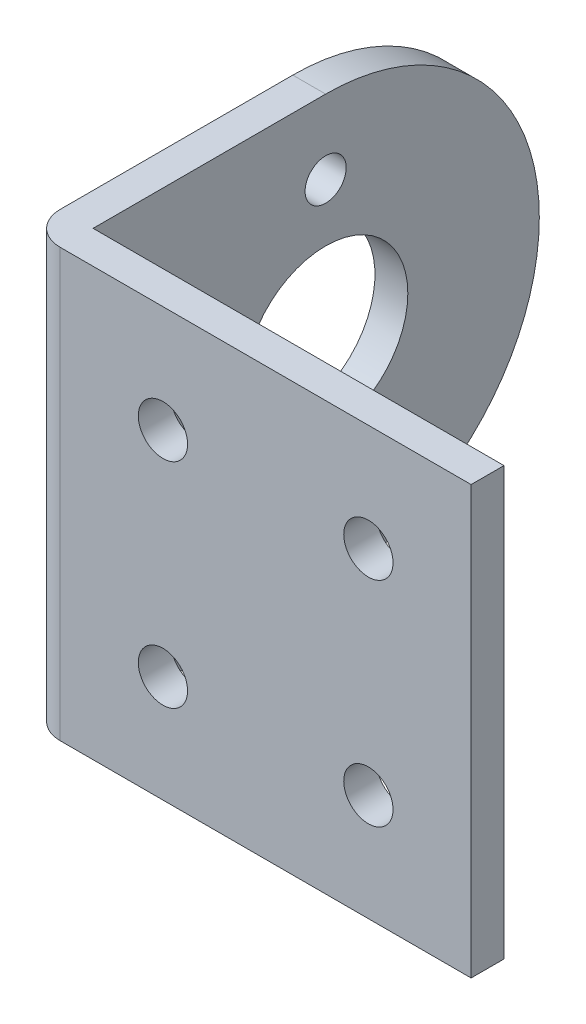
ISO-10303-21;
HEADER;
FILE_DESCRIPTION(('STEP AP214'),'2;1');
FILE_NAME('part.step','',(''),(''),'','','');
FILE_SCHEMA(('AUTOMOTIVE_DESIGN { 1 0 10303 214 1 1 1 1 }'));
ENDSEC;
DATA;
#1=APPLICATION_CONTEXT('core data for automotive mechanical design processes');
#2=APPLICATION_PROTOCOL_DEFINITION('international standard','automotive_design',2000,#1);
#3=PRODUCT_CONTEXT('',#1,'mechanical');
#4=PRODUCT('Part','Part','',(#3));
#5=PRODUCT_RELATED_PRODUCT_CATEGORY('part','',(#4));
#6=PRODUCT_DEFINITION_FORMATION('','',#4);
#7=PRODUCT_DEFINITION_CONTEXT('part definition',#1,'design');
#8=PRODUCT_DEFINITION('design','',#6,#7);
#9=PRODUCT_DEFINITION_SHAPE('','',#8);
#10=(LENGTH_UNIT() NAMED_UNIT(*) SI_UNIT(.MILLI.,.METRE.));
#11=(NAMED_UNIT(*) PLANE_ANGLE_UNIT() SI_UNIT($,.RADIAN.));
#12=(NAMED_UNIT(*) SI_UNIT($,.STERADIAN.) SOLID_ANGLE_UNIT());
#13=UNCERTAINTY_MEASURE_WITH_UNIT(LENGTH_MEASURE(1.E-05),#10,'distance_accuracy_value','');
#14=(GEOMETRIC_REPRESENTATION_CONTEXT(3) GLOBAL_UNCERTAINTY_ASSIGNED_CONTEXT((#13)) GLOBAL_UNIT_ASSIGNED_CONTEXT((#10,
#11,#12)) REPRESENTATION_CONTEXT('',''));
#15=CARTESIAN_POINT('',(0.,0.,0.));
#16=DIRECTION('',(0.,0.,1.));
#17=DIRECTION('',(1.,0.,0.));
#18=AXIS2_PLACEMENT_3D('',#15,#16,#17);
#19=CARTESIAN_POINT('',(0.,0.,2.));
#20=DIRECTION('',(0.,0.,1.));
#21=DIRECTION('',(1.,0.,0.));
#22=AXIS2_PLACEMENT_3D('',#19,#20,#21);
#23=PLANE('',#22);
#24=CARTESIAN_POINT('',(6.25,6.5,2.));
#25=DIRECTION('',(0.,0.,-1.));
#26=DIRECTION('',(-1.,0.,0.));
#27=AXIS2_PLACEMENT_3D('',#24,#25,#26);
#28=CIRCLE('',#27,1.5);
#29=CARTESIAN_POINT('',(4.75,6.5,2.));
#30=VERTEX_POINT('',#29);
#31=EDGE_CURVE('E141',#30,#30,#28,.T.);
#32=ORIENTED_EDGE('',*,*,#31,.T.);
#33=EDGE_LOOP('',(#32));
#34=FACE_BOUND('',#33,.T.);
#35=CARTESIAN_POINT('',(-6.25,6.5,2.));
#36=DIRECTION('',(0.,0.,-1.));
#37=DIRECTION('',(-1.,0.,0.));
#38=AXIS2_PLACEMENT_3D('',#35,#36,#37);
#39=CIRCLE('',#38,1.5);
#40=CARTESIAN_POINT('',(-7.75,6.5,2.));
#41=VERTEX_POINT('',#40);
#42=EDGE_CURVE('E135',#41,#41,#39,.T.);
#43=ORIENTED_EDGE('',*,*,#42,.T.);
#44=EDGE_LOOP('',(#43));
#45=FACE_BOUND('',#44,.T.);
#46=CARTESIAN_POINT('',(-6.25000000000001,-6.5,2.));
#47=DIRECTION('',(0.,0.,-1.));
#48=DIRECTION('',(-1.,0.,0.));
#49=AXIS2_PLACEMENT_3D('',#46,#47,#48);
#50=CIRCLE('',#49,1.5);
#51=CARTESIAN_POINT('',(-7.75000000000001,-6.5,2.));
#52=VERTEX_POINT('',#51);
#53=EDGE_CURVE('E128',#52,#52,#50,.T.);
#54=ORIENTED_EDGE('',*,*,#53,.T.);
#55=EDGE_LOOP('',(#54));
#56=FACE_BOUND('',#55,.T.);
#57=CARTESIAN_POINT('',(6.24999999999999,-6.5,2.));
#58=DIRECTION('',(0.,0.,-1.));
#59=DIRECTION('',(-1.,0.,0.));
#60=AXIS2_PLACEMENT_3D('',#57,#58,#59);
#61=CIRCLE('',#60,1.5);
#62=CARTESIAN_POINT('',(4.74999999999999,-6.5,2.));
#63=VERTEX_POINT('',#62);
#64=EDGE_CURVE('E146',#63,#63,#61,.T.);
#65=ORIENTED_EDGE('',*,*,#64,.T.);
#66=EDGE_LOOP('',(#65));
#67=FACE_BOUND('',#66,.T.);
#68=DIRECTION('',(0.,1.,0.));
#69=VECTOR('',#68,1.);
#70=CARTESIAN_POINT('',(12.5,-13.,2.));
#71=LINE('',#70,#69);
#72=CARTESIAN_POINT('',(12.5,-13.,2.));
#73=VERTEX_POINT('',#72);
#74=CARTESIAN_POINT('',(12.5,13.,2.));
#75=VERTEX_POINT('',#74);
#76=EDGE_CURVE('E88',#73,#75,#71,.T.);
#77=ORIENTED_EDGE('',*,*,#76,.T.);
#78=DIRECTION('',(-1.,0.,0.));
#79=VECTOR('',#78,1.);
#80=CARTESIAN_POINT('',(12.5,13.,2.));
#81=LINE('',#80,#79);
#82=CARTESIAN_POINT('',(-12.5,13.,2.));
#83=VERTEX_POINT('',#82);
#84=EDGE_CURVE('E178',#75,#83,#81,.T.);
#85=ORIENTED_EDGE('',*,*,#84,.T.);
#86=DIRECTION('',(0.,-1.,0.));
#87=VECTOR('',#86,1.);
#88=CARTESIAN_POINT('',(-12.5,13.,2.));
#89=LINE('',#88,#87);
#90=CARTESIAN_POINT('',(-12.5,-13.,2.));
#91=VERTEX_POINT('',#90);
#92=EDGE_CURVE('E180',#83,#91,#89,.T.);
#93=ORIENTED_EDGE('',*,*,#92,.T.);
#94=DIRECTION('',(1.,0.,0.));
#95=VECTOR('',#94,1.);
#96=CARTESIAN_POINT('',(-12.5,-13.,2.));
#97=LINE('',#96,#95);
#98=EDGE_CURVE('E60',#91,#73,#97,.T.);
#99=ORIENTED_EDGE('',*,*,#98,.T.);
#100=EDGE_LOOP('',(#77,#85,#93,#99));
#101=FACE_BOUND('',#100,.T.);
#102=ADVANCED_FACE('F41',(#34,#45,#56,#67,#101),#23,.T.);
#103=CARTESIAN_POINT('',(0.,0.,0.));
#104=DIRECTION('',(0.,0.,1.));
#105=DIRECTION('',(1.,0.,0.));
#106=AXIS2_PLACEMENT_3D('',#103,#104,#105);
#107=PLANE('',#106);
#108=CARTESIAN_POINT('',(6.25,6.5,0.));
#109=DIRECTION('',(0.,0.,-1.));
#110=DIRECTION('',(-1.,0.,0.));
#111=AXIS2_PLACEMENT_3D('',#108,#109,#110);
#112=CIRCLE('',#111,1.5);
#113=CARTESIAN_POINT('',(4.75,6.5,0.));
#114=VERTEX_POINT('',#113);
#115=EDGE_CURVE('E110',#114,#114,#112,.T.);
#116=ORIENTED_EDGE('',*,*,#115,.F.);
#117=EDGE_LOOP('',(#116));
#118=FACE_BOUND('',#117,.T.);
#119=CARTESIAN_POINT('',(-6.25,6.5,0.));
#120=DIRECTION('',(0.,0.,-1.));
#121=DIRECTION('',(-1.,0.,0.));
#122=AXIS2_PLACEMENT_3D('',#119,#120,#121);
#123=CIRCLE('',#122,1.5);
#124=CARTESIAN_POINT('',(-7.75,6.5,0.));
#125=VERTEX_POINT('',#124);
#126=EDGE_CURVE('E138',#125,#125,#123,.T.);
#127=ORIENTED_EDGE('',*,*,#126,.F.);
#128=EDGE_LOOP('',(#127));
#129=FACE_BOUND('',#128,.T.);
#130=CARTESIAN_POINT('',(-6.25000000000001,-6.5,0.));
#131=DIRECTION('',(0.,0.,-1.));
#132=DIRECTION('',(-1.,0.,0.));
#133=AXIS2_PLACEMENT_3D('',#130,#131,#132);
#134=CIRCLE('',#133,1.5);
#135=CARTESIAN_POINT('',(-7.75000000000001,-6.5,0.));
#136=VERTEX_POINT('',#135);
#137=EDGE_CURVE('E132',#136,#136,#134,.T.);
#138=ORIENTED_EDGE('',*,*,#137,.F.);
#139=EDGE_LOOP('',(#138));
#140=FACE_BOUND('',#139,.T.);
#141=CARTESIAN_POINT('',(6.24999999999999,-6.5,0.));
#142=DIRECTION('',(0.,0.,-1.));
#143=DIRECTION('',(-1.,0.,0.));
#144=AXIS2_PLACEMENT_3D('',#141,#142,#143);
#145=CIRCLE('',#144,1.5);
#146=CARTESIAN_POINT('',(4.74999999999999,-6.5,0.));
#147=VERTEX_POINT('',#146);
#148=EDGE_CURVE('E131',#147,#147,#145,.T.);
#149=ORIENTED_EDGE('',*,*,#148,.F.);
#150=EDGE_LOOP('',(#149));
#151=FACE_BOUND('',#150,.T.);
#152=DIRECTION('',(0.,1.,0.));
#153=VECTOR('',#152,1.);
#154=CARTESIAN_POINT('',(12.5,-13.,0.));
#155=LINE('',#154,#153);
#156=CARTESIAN_POINT('',(12.5,-13.,0.));
#157=VERTEX_POINT('',#156);
#158=CARTESIAN_POINT('',(12.5,13.,0.));
#159=VERTEX_POINT('',#158);
#160=EDGE_CURVE('E93',#157,#159,#155,.T.);
#161=ORIENTED_EDGE('',*,*,#160,.F.);
#162=DIRECTION('',(1.,0.,0.));
#163=VECTOR('',#162,1.);
#164=CARTESIAN_POINT('',(-12.5,-13.,0.));
#165=LINE('',#164,#163);
#166=CARTESIAN_POINT('',(-12.5,-13.,0.));
#167=VERTEX_POINT('',#166);
#168=EDGE_CURVE('E80',#167,#157,#165,.T.);
#169=ORIENTED_EDGE('',*,*,#168,.F.);
#170=DIRECTION('',(0.,-1.,0.));
#171=VECTOR('',#170,1.);
#172=CARTESIAN_POINT('',(-12.5,13.,0.));
#173=LINE('',#172,#171);
#174=CARTESIAN_POINT('',(-12.5,13.,0.));
#175=VERTEX_POINT('',#174);
#176=EDGE_CURVE('E75',#175,#167,#173,.T.);
#177=ORIENTED_EDGE('',*,*,#176,.F.);
#178=DIRECTION('',(-1.,0.,0.));
#179=VECTOR('',#178,1.);
#180=CARTESIAN_POINT('',(12.5,13.,0.));
#181=LINE('',#180,#179);
#182=EDGE_CURVE('E97',#159,#175,#181,.T.);
#183=ORIENTED_EDGE('',*,*,#182,.F.);
#184=EDGE_LOOP('',(#161,#169,#177,#183));
#185=FACE_BOUND('',#184,.T.);
#186=ADVANCED_FACE('F95',(#118,#129,#140,#151,#185),#107,.F.);
#187=CARTESIAN_POINT('',(12.5,-13.,2.));
#188=DIRECTION('',(-1.,0.,0.));
#189=DIRECTION('',(0.,-1.,0.));
#190=AXIS2_PLACEMENT_3D('',#187,#188,#189);
#191=PLANE('',#190);
#192=ORIENTED_EDGE('',*,*,#160,.T.);
#193=DIRECTION('',(0.,0.,-1.));
#194=VECTOR('',#193,1.);
#195=CARTESIAN_POINT('',(12.5,13.,2.));
#196=LINE('',#195,#194);
#197=EDGE_CURVE('E11',#75,#159,#196,.T.);
#198=ORIENTED_EDGE('',*,*,#197,.F.);
#199=ORIENTED_EDGE('',*,*,#76,.F.);
#200=DIRECTION('',(0.,0.,-1.));
#201=VECTOR('',#200,1.);
#202=CARTESIAN_POINT('',(12.5,-13.,2.));
#203=LINE('',#202,#201);
#204=EDGE_CURVE('E51',#73,#157,#203,.T.);
#205=ORIENTED_EDGE('',*,*,#204,.T.);
#206=EDGE_LOOP('',(#192,#198,#199,#205));
#207=FACE_BOUND('',#206,.T.);
#208=ADVANCED_FACE('F43',(#207),#191,.F.);
#209=CARTESIAN_POINT('',(12.5,13.,2.));
#210=DIRECTION('',(0.,-1.,0.));
#211=DIRECTION('',(1.,0.,0.));
#212=AXIS2_PLACEMENT_3D('',#209,#210,#211);
#213=PLANE('',#212);
#214=ORIENTED_EDGE('',*,*,#182,.T.);
#215=DIRECTION('',(0.,0.,-1.));
#216=VECTOR('',#215,1.);
#217=CARTESIAN_POINT('',(-12.5,13.,0.));
#218=LINE('',#217,#216);
#219=CARTESIAN_POINT('',(-12.5,13.,-14.15));
#220=VERTEX_POINT('',#219);
#221=EDGE_CURVE('E166',#175,#220,#218,.T.);
#222=ORIENTED_EDGE('',*,*,#221,.T.);
#223=DIRECTION('',(-1.,0.,0.));
#224=VECTOR('',#223,1.);
#225=CARTESIAN_POINT('',(-12.5,13.,-14.15));
#226=LINE('',#225,#224);
#227=CARTESIAN_POINT('',(-14.5,13.,-14.15));
#228=VERTEX_POINT('',#227);
#229=EDGE_CURVE('E169',#220,#228,#226,.T.);
#230=ORIENTED_EDGE('',*,*,#229,.T.);
#231=DIRECTION('',(0.,0.,1.));
#232=VECTOR('',#231,1.);
#233=CARTESIAN_POINT('',(-14.5,13.,-14.15));
#234=LINE('',#233,#232);
#235=CARTESIAN_POINT('',(-14.5,13.,0.));
#236=VERTEX_POINT('',#235);
#237=EDGE_CURVE('E172',#228,#236,#234,.T.);
#238=ORIENTED_EDGE('',*,*,#237,.T.);
#239=CARTESIAN_POINT('',(-12.5,13.,0.));
#240=DIRECTION('',(0.,1.,0.));
#241=DIRECTION('',(0.,0.,1.));
#242=AXIS2_PLACEMENT_3D('',#239,#240,#241);
#243=CIRCLE('',#242,2.);
#244=EDGE_CURVE('E157',#236,#83,#243,.T.);
#245=ORIENTED_EDGE('',*,*,#244,.T.);
#246=ORIENTED_EDGE('',*,*,#84,.F.);
#247=ORIENTED_EDGE('',*,*,#197,.T.);
#248=EDGE_LOOP('',(#214,#222,#230,#238,#245,#246,#247));
#249=FACE_BOUND('',#248,.T.);
#250=ADVANCED_FACE('F200',(#249),#213,.F.);
#251=CARTESIAN_POINT('',(-12.5,-13.,2.));
#252=DIRECTION('',(0.,1.,0.));
#253=DIRECTION('',(0.,0.,1.));
#254=AXIS2_PLACEMENT_3D('',#251,#252,#253);
#255=PLANE('',#254);
#256=ORIENTED_EDGE('',*,*,#168,.T.);
#257=ORIENTED_EDGE('',*,*,#204,.F.);
#258=ORIENTED_EDGE('',*,*,#98,.F.);
#259=CARTESIAN_POINT('',(-12.5,-13.,0.));
#260=DIRECTION('',(0.,1.,0.));
#261=DIRECTION('',(0.,0.,1.));
#262=AXIS2_PLACEMENT_3D('',#259,#260,#261);
#263=CIRCLE('',#262,2.);
#264=CARTESIAN_POINT('',(-14.5,-13.,0.));
#265=VERTEX_POINT('',#264);
#266=EDGE_CURVE('E98',#91,#265,#263,.F.);
#267=ORIENTED_EDGE('',*,*,#266,.T.);
#268=DIRECTION('',(0.,0.,-1.));
#269=VECTOR('',#268,1.);
#270=CARTESIAN_POINT('',(-14.5,-13.,-14.15));
#271=LINE('',#270,#269);
#272=CARTESIAN_POINT('',(-14.5,-13.,-14.15));
#273=VERTEX_POINT('',#272);
#274=EDGE_CURVE('E102',#265,#273,#271,.T.);
#275=ORIENTED_EDGE('',*,*,#274,.T.);
#276=DIRECTION('',(1.,0.,0.));
#277=VECTOR('',#276,1.);
#278=CARTESIAN_POINT('',(-12.5,-13.,-14.15));
#279=LINE('',#278,#277);
#280=CARTESIAN_POINT('',(-12.5,-13.,-14.15));
#281=VERTEX_POINT('',#280);
#282=EDGE_CURVE('E159',#273,#281,#279,.T.);
#283=ORIENTED_EDGE('',*,*,#282,.T.);
#284=DIRECTION('',(0.,0.,1.));
#285=VECTOR('',#284,1.);
#286=CARTESIAN_POINT('',(-12.5,-13.,0.));
#287=LINE('',#286,#285);
#288=EDGE_CURVE('E85',#281,#167,#287,.T.);
#289=ORIENTED_EDGE('',*,*,#288,.T.);
#290=EDGE_LOOP('',(#256,#257,#258,#267,#275,#283,#289));
#291=FACE_BOUND('',#290,.T.);
#292=ADVANCED_FACE('F82',(#291),#255,.F.);
#293=CARTESIAN_POINT('',(-12.5,-44.4614446585023,0.));
#294=DIRECTION('',(0.,1.,0.));
#295=DIRECTION('',(0.,0.,1.));
#296=AXIS2_PLACEMENT_3D('',#293,#294,#295);
#297=CYLINDRICAL_SURFACE('',#296,2.);
#298=ORIENTED_EDGE('',*,*,#266,.F.);
#299=ORIENTED_EDGE('',*,*,#92,.F.);
#300=ORIENTED_EDGE('',*,*,#244,.F.);
#301=DIRECTION('',(0.,1.,0.));
#302=VECTOR('',#301,1.);
#303=CARTESIAN_POINT('',(-14.5,-44.4614446585023,0.));
#304=LINE('',#303,#302);
#305=EDGE_CURVE('E160',#265,#236,#304,.T.);
#306=ORIENTED_EDGE('',*,*,#305,.F.);
#307=EDGE_LOOP('',(#298,#299,#300,#306));
#308=FACE_BOUND('',#307,.T.);
#309=ADVANCED_FACE('F196',(#308),#297,.T.);
#310=CARTESIAN_POINT('',(-14.5,-44.4614446585023,-14.15));
#311=DIRECTION('',(-1.,0.,0.));
#312=DIRECTION('',(0.,0.,1.));
#313=AXIS2_PLACEMENT_3D('',#310,#311,#312);
#314=PLANE('',#313);
#315=CARTESIAN_POINT('',(-14.5,8.5,-14.15));
#316=DIRECTION('',(-1.,0.,0.));
#317=DIRECTION('',(0.,0.,1.));
#318=AXIS2_PLACEMENT_3D('',#315,#316,#317);
#319=CIRCLE('',#318,1.25);
#320=CARTESIAN_POINT('',(-14.5,8.5,-12.9));
#321=VERTEX_POINT('',#320);
#322=EDGE_CURVE('E114',#321,#321,#319,.T.);
#323=ORIENTED_EDGE('',*,*,#322,.F.);
#324=EDGE_LOOP('',(#323));
#325=FACE_BOUND('',#324,.T.);
#326=CARTESIAN_POINT('',(-14.5,-8.5,-14.15));
#327=DIRECTION('',(-1.,0.,0.));
#328=DIRECTION('',(0.,0.,-1.));
#329=AXIS2_PLACEMENT_3D('',#326,#327,#328);
#330=CIRCLE('',#329,1.24999999999999);
#331=CARTESIAN_POINT('',(-14.5,-8.5,-15.4));
#332=VERTEX_POINT('',#331);
#333=EDGE_CURVE('E119',#332,#332,#330,.T.);
#334=ORIENTED_EDGE('',*,*,#333,.F.);
#335=EDGE_LOOP('',(#334));
#336=FACE_BOUND('',#335,.T.);
#337=CARTESIAN_POINT('',(-14.5,0.,-14.15));
#338=DIRECTION('',(-1.,0.,0.));
#339=DIRECTION('',(0.,0.,1.));
#340=AXIS2_PLACEMENT_3D('',#337,#338,#339);
#341=CIRCLE('',#340,5.);
#342=CARTESIAN_POINT('',(-14.5,0.,-9.15));
#343=VERTEX_POINT('',#342);
#344=EDGE_CURVE('E111',#343,#343,#341,.T.);
#345=ORIENTED_EDGE('',*,*,#344,.F.);
#346=EDGE_LOOP('',(#345));
#347=FACE_BOUND('',#346,.T.);
#348=ORIENTED_EDGE('',*,*,#274,.F.);
#349=ORIENTED_EDGE('',*,*,#305,.T.);
#350=ORIENTED_EDGE('',*,*,#237,.F.);
#351=CARTESIAN_POINT('',(-14.5,0.,-14.15));
#352=DIRECTION('',(-1.,0.,0.));
#353=DIRECTION('',(0.,0.,-1.));
#354=AXIS2_PLACEMENT_3D('',#351,#352,#353);
#355=CIRCLE('',#354,13.);
#356=EDGE_CURVE('E149',#228,#273,#355,.T.);
#357=ORIENTED_EDGE('',*,*,#356,.T.);
#358=EDGE_LOOP('',(#348,#349,#350,#357));
#359=FACE_BOUND('',#358,.T.);
#360=ADVANCED_FACE('F193',(#325,#336,#347,#359),#314,.T.);
#361=CARTESIAN_POINT('',(-12.5,-44.4614446585023,0.));
#362=DIRECTION('',(1.,0.,0.));
#363=DIRECTION('',(0.,0.,-1.));
#364=AXIS2_PLACEMENT_3D('',#361,#362,#363);
#365=PLANE('',#364);
#366=CARTESIAN_POINT('',(-12.5,8.5,-14.15));
#367=DIRECTION('',(1.,0.,0.));
#368=DIRECTION('',(0.,0.,-1.));
#369=AXIS2_PLACEMENT_3D('',#366,#367,#368);
#370=CIRCLE('',#369,1.25);
#371=CARTESIAN_POINT('',(-12.5,8.5,-15.4));
#372=VERTEX_POINT('',#371);
#373=EDGE_CURVE('E45',#372,#372,#370,.T.);
#374=ORIENTED_EDGE('',*,*,#373,.F.);
#375=EDGE_LOOP('',(#374));
#376=FACE_BOUND('',#375,.T.);
#377=CARTESIAN_POINT('',(-12.5,-8.5,-14.15));
#378=DIRECTION('',(1.,0.,0.));
#379=DIRECTION('',(0.,0.,-1.));
#380=AXIS2_PLACEMENT_3D('',#377,#378,#379);
#381=CIRCLE('',#380,1.24999999999999);
#382=CARTESIAN_POINT('',(-12.5,-8.5,-15.4));
#383=VERTEX_POINT('',#382);
#384=EDGE_CURVE('E112',#383,#383,#381,.T.);
#385=ORIENTED_EDGE('',*,*,#384,.F.);
#386=EDGE_LOOP('',(#385));
#387=FACE_BOUND('',#386,.T.);
#388=CARTESIAN_POINT('',(-12.5,0.,-14.15));
#389=DIRECTION('',(1.,0.,0.));
#390=DIRECTION('',(0.,0.,-1.));
#391=AXIS2_PLACEMENT_3D('',#388,#389,#390);
#392=CIRCLE('',#391,5.);
#393=CARTESIAN_POINT('',(-12.5,0.,-19.15));
#394=VERTEX_POINT('',#393);
#395=EDGE_CURVE('E108',#394,#394,#392,.T.);
#396=ORIENTED_EDGE('',*,*,#395,.F.);
#397=EDGE_LOOP('',(#396));
#398=FACE_BOUND('',#397,.T.);
#399=ORIENTED_EDGE('',*,*,#288,.F.);
#400=CARTESIAN_POINT('',(-12.5,0.,-14.15));
#401=DIRECTION('',(1.,0.,0.));
#402=DIRECTION('',(0.,0.,-1.));
#403=AXIS2_PLACEMENT_3D('',#400,#401,#402);
#404=CIRCLE('',#403,13.);
#405=EDGE_CURVE('E154',#220,#281,#404,.F.);
#406=ORIENTED_EDGE('',*,*,#405,.F.);
#407=ORIENTED_EDGE('',*,*,#221,.F.);
#408=ORIENTED_EDGE('',*,*,#176,.T.);
#409=EDGE_LOOP('',(#399,#406,#407,#408));
#410=FACE_BOUND('',#409,.T.);
#411=ADVANCED_FACE('F215',(#376,#387,#398,#410),#365,.T.);
#412=CARTESIAN_POINT('',(16.5688837074973,0.,-14.15));
#413=DIRECTION('',(-1.,0.,0.));
#414=DIRECTION('',(0.,0.,1.));
#415=AXIS2_PLACEMENT_3D('',#412,#413,#414);
#416=CYLINDRICAL_SURFACE('',#415,13.);
#417=ORIENTED_EDGE('',*,*,#229,.F.);
#418=ORIENTED_EDGE('',*,*,#405,.T.);
#419=ORIENTED_EDGE('',*,*,#282,.F.);
#420=ORIENTED_EDGE('',*,*,#356,.F.);
#421=EDGE_LOOP('',(#417,#418,#419,#420));
#422=FACE_BOUND('',#421,.T.);
#423=ADVANCED_FACE('F214',(#422),#416,.T.);
#424=CARTESIAN_POINT('',(6.24999999999999,-6.5,2.));
#425=DIRECTION('',(0.,0.,-1.));
#426=DIRECTION('',(-1.,0.,0.));
#427=AXIS2_PLACEMENT_3D('',#424,#425,#426);
#428=CYLINDRICAL_SURFACE('',#427,1.5);
#429=ORIENTED_EDGE('',*,*,#64,.F.);
#430=EDGE_LOOP('',(#429));
#431=FACE_BOUND('',#430,.T.);
#432=ORIENTED_EDGE('',*,*,#148,.T.);
#433=EDGE_LOOP('',(#432));
#434=FACE_BOUND('',#433,.T.);
#435=ADVANCED_FACE('F223',(#431,#434),#428,.F.);
#436=CARTESIAN_POINT('',(-6.25000000000001,-6.5,2.));
#437=DIRECTION('',(0.,0.,-1.));
#438=DIRECTION('',(-1.,0.,0.));
#439=AXIS2_PLACEMENT_3D('',#436,#437,#438);
#440=CYLINDRICAL_SURFACE('',#439,1.5);
#441=ORIENTED_EDGE('',*,*,#53,.F.);
#442=EDGE_LOOP('',(#441));
#443=FACE_BOUND('',#442,.T.);
#444=ORIENTED_EDGE('',*,*,#137,.T.);
#445=EDGE_LOOP('',(#444));
#446=FACE_BOUND('',#445,.T.);
#447=ADVANCED_FACE('F266',(#443,#446),#440,.F.);
#448=CARTESIAN_POINT('',(-6.25,6.5,2.));
#449=DIRECTION('',(0.,0.,-1.));
#450=DIRECTION('',(-1.,0.,0.));
#451=AXIS2_PLACEMENT_3D('',#448,#449,#450);
#452=CYLINDRICAL_SURFACE('',#451,1.5);
#453=ORIENTED_EDGE('',*,*,#42,.F.);
#454=EDGE_LOOP('',(#453));
#455=FACE_BOUND('',#454,.T.);
#456=ORIENTED_EDGE('',*,*,#126,.T.);
#457=EDGE_LOOP('',(#456));
#458=FACE_BOUND('',#457,.T.);
#459=ADVANCED_FACE('F278',(#455,#458),#452,.F.);
#460=CARTESIAN_POINT('',(6.25,6.5,2.));
#461=DIRECTION('',(0.,0.,-1.));
#462=DIRECTION('',(-1.,0.,0.));
#463=AXIS2_PLACEMENT_3D('',#460,#461,#462);
#464=CYLINDRICAL_SURFACE('',#463,1.5);
#465=ORIENTED_EDGE('',*,*,#31,.F.);
#466=EDGE_LOOP('',(#465));
#467=FACE_BOUND('',#466,.T.);
#468=ORIENTED_EDGE('',*,*,#115,.T.);
#469=EDGE_LOOP('',(#468));
#470=FACE_BOUND('',#469,.T.);
#471=ADVANCED_FACE('F289',(#467,#470),#464,.F.);
#472=CARTESIAN_POINT('',(12.5,0.,-14.15));
#473=DIRECTION('',(-1.,0.,0.));
#474=DIRECTION('',(0.,0.,1.));
#475=AXIS2_PLACEMENT_3D('',#472,#473,#474);
#476=CYLINDRICAL_SURFACE('',#475,5.);
#477=ORIENTED_EDGE('',*,*,#395,.T.);
#478=EDGE_LOOP('',(#477));
#479=FACE_BOUND('',#478,.T.);
#480=ORIENTED_EDGE('',*,*,#344,.T.);
#481=EDGE_LOOP('',(#480));
#482=FACE_BOUND('',#481,.T.);
#483=ADVANCED_FACE('F300',(#479,#482),#476,.F.);
#484=CARTESIAN_POINT('',(12.5,-8.5,-14.15));
#485=DIRECTION('',(-1.,0.,0.));
#486=DIRECTION('',(0.,0.,1.));
#487=AXIS2_PLACEMENT_3D('',#484,#485,#486);
#488=CYLINDRICAL_SURFACE('',#487,1.24999999999999);
#489=ORIENTED_EDGE('',*,*,#384,.T.);
#490=EDGE_LOOP('',(#489));
#491=FACE_BOUND('',#490,.T.);
#492=ORIENTED_EDGE('',*,*,#333,.T.);
#493=EDGE_LOOP('',(#492));
#494=FACE_BOUND('',#493,.T.);
#495=ADVANCED_FACE('F311',(#491,#494),#488,.F.);
#496=CARTESIAN_POINT('',(12.5,8.5,-14.15));
#497=DIRECTION('',(-1.,0.,0.));
#498=DIRECTION('',(0.,0.,1.));
#499=AXIS2_PLACEMENT_3D('',#496,#497,#498);
#500=CYLINDRICAL_SURFACE('',#499,1.25);
#501=ORIENTED_EDGE('',*,*,#373,.T.);
#502=EDGE_LOOP('',(#501));
#503=FACE_BOUND('',#502,.T.);
#504=ORIENTED_EDGE('',*,*,#322,.T.);
#505=EDGE_LOOP('',(#504));
#506=FACE_BOUND('',#505,.T.);
#507=ADVANCED_FACE('F335',(#503,#506),#500,.F.);
#508=CLOSED_SHELL('',(#102,#186,#208,#250,#292,#309,#360,#411,#423,#435,#447,#459,#471,#483,
#495,#507));
#509=MANIFOLD_SOLID_BREP('B2',#508);
#510=ADVANCED_BREP_SHAPE_REPRESENTATION('',(#18,#509),#14);
#511=SHAPE_DEFINITION_REPRESENTATION(#9,#510);
ENDSEC;
END-ISO-10303-21;
